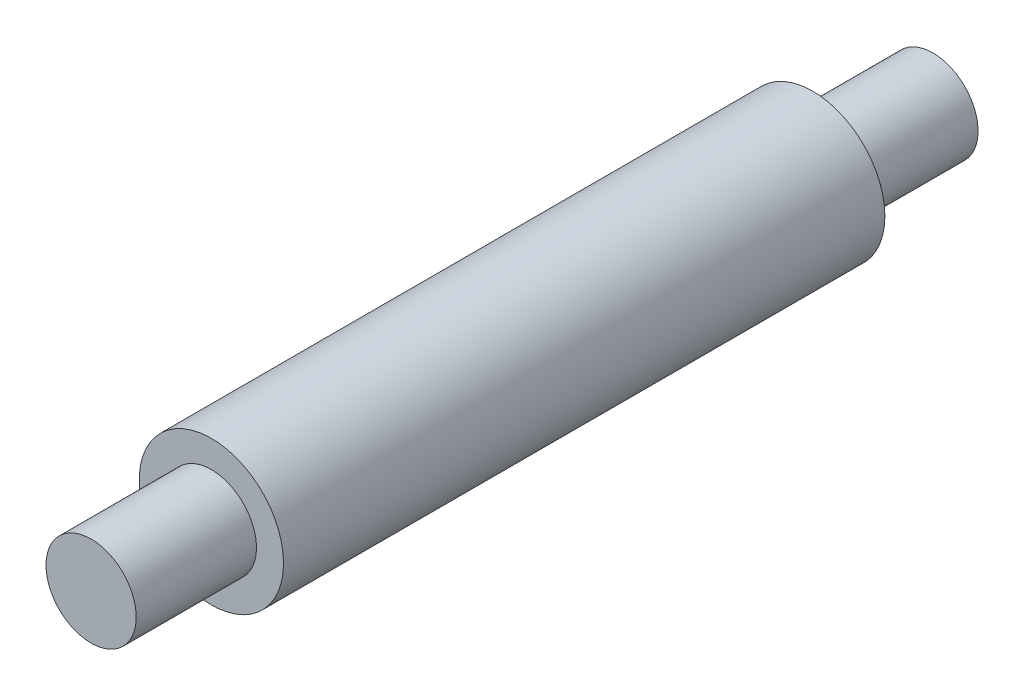
ISO-10303-21;
HEADER;
FILE_DESCRIPTION(('STEP AP214'),'2;1');
FILE_NAME('part.step','',(''),(''),'','','');
FILE_SCHEMA(('AUTOMOTIVE_DESIGN { 1 0 10303 214 1 1 1 1 }'));
ENDSEC;
DATA;
#1=APPLICATION_CONTEXT('core data for automotive mechanical design processes');
#2=APPLICATION_PROTOCOL_DEFINITION('international standard','automotive_design',2000,#1);
#3=PRODUCT_CONTEXT('',#1,'mechanical');
#4=PRODUCT('Part','Part','',(#3));
#5=PRODUCT_RELATED_PRODUCT_CATEGORY('part','',(#4));
#6=PRODUCT_DEFINITION_FORMATION('','',#4);
#7=PRODUCT_DEFINITION_CONTEXT('part definition',#1,'design');
#8=PRODUCT_DEFINITION('design','',#6,#7);
#9=PRODUCT_DEFINITION_SHAPE('','',#8);
#10=(LENGTH_UNIT() NAMED_UNIT(*) SI_UNIT(.MILLI.,.METRE.));
#11=(NAMED_UNIT(*) PLANE_ANGLE_UNIT() SI_UNIT($,.RADIAN.));
#12=(NAMED_UNIT(*) SI_UNIT($,.STERADIAN.) SOLID_ANGLE_UNIT());
#13=UNCERTAINTY_MEASURE_WITH_UNIT(LENGTH_MEASURE(1.E-05),#10,'distance_accuracy_value','');
#14=(GEOMETRIC_REPRESENTATION_CONTEXT(3) GLOBAL_UNCERTAINTY_ASSIGNED_CONTEXT((#13)) GLOBAL_UNIT_ASSIGNED_CONTEXT((#10,
#11,#12)) REPRESENTATION_CONTEXT('',''));
#15=CARTESIAN_POINT('',(0.,0.,0.));
#16=DIRECTION('',(0.,0.,1.));
#17=DIRECTION('',(1.,0.,0.));
#18=AXIS2_PLACEMENT_3D('',#15,#16,#17);
#19=CARTESIAN_POINT('',(0.,0.,200.));
#20=DIRECTION('',(0.,0.,-1.));
#21=DIRECTION('',(-1.,0.,0.));
#22=AXIS2_PLACEMENT_3D('',#19,#20,#21);
#23=CYLINDRICAL_SURFACE('',#22,24.);
#24=CARTESIAN_POINT('',(0.,0.,200.));
#25=DIRECTION('',(0.,0.,1.));
#26=DIRECTION('',(1.,0.,0.));
#27=AXIS2_PLACEMENT_3D('',#24,#25,#26);
#28=CIRCLE('',#27,24.);
#29=CARTESIAN_POINT('',(24.,0.,200.));
#30=VERTEX_POINT('',#29);
#31=EDGE_CURVE('E45',#30,#30,#28,.T.);
#32=ORIENTED_EDGE('',*,*,#31,.F.);
#33=EDGE_LOOP('',(#32));
#34=FACE_BOUND('',#33,.T.);
#35=CARTESIAN_POINT('',(0.,0.,0.));
#36=DIRECTION('',(0.,0.,1.));
#37=DIRECTION('',(1.,0.,0.));
#38=AXIS2_PLACEMENT_3D('',#35,#36,#37);
#39=CIRCLE('',#38,24.);
#40=CARTESIAN_POINT('',(24.,0.,0.));
#41=VERTEX_POINT('',#40);
#42=EDGE_CURVE('E40',#41,#41,#39,.T.);
#43=ORIENTED_EDGE('',*,*,#42,.T.);
#44=EDGE_LOOP('',(#43));
#45=FACE_BOUND('',#44,.T.);
#46=ADVANCED_FACE('F37',(#34,#45),#23,.T.);
#47=CARTESIAN_POINT('',(0.,0.,200.));
#48=DIRECTION('',(0.,0.,1.));
#49=DIRECTION('',(1.,0.,0.));
#50=AXIS2_PLACEMENT_3D('',#47,#48,#49);
#51=PLANE('',#50);
#52=CARTESIAN_POINT('',(0.,0.,200.));
#53=DIRECTION('',(0.,0.,-1.));
#54=DIRECTION('',(-1.,0.,0.));
#55=AXIS2_PLACEMENT_3D('',#52,#53,#54);
#56=CIRCLE('',#55,15.);
#57=CARTESIAN_POINT('',(-15.,0.,200.));
#58=VERTEX_POINT('',#57);
#59=EDGE_CURVE('E56',#58,#58,#56,.T.);
#60=ORIENTED_EDGE('',*,*,#59,.T.);
#61=EDGE_LOOP('',(#60));
#62=FACE_BOUND('',#61,.T.);
#63=ORIENTED_EDGE('',*,*,#31,.T.);
#64=EDGE_LOOP('',(#63));
#65=FACE_BOUND('',#64,.T.);
#66=ADVANCED_FACE('F65',(#62,#65),#51,.T.);
#67=CARTESIAN_POINT('',(0.,0.,0.));
#68=DIRECTION('',(0.,0.,1.));
#69=DIRECTION('',(1.,0.,0.));
#70=AXIS2_PLACEMENT_3D('',#67,#68,#69);
#71=PLANE('',#70);
#72=CARTESIAN_POINT('',(0.,0.,0.));
#73=DIRECTION('',(0.,0.,-1.));
#74=DIRECTION('',(-1.,0.,0.));
#75=AXIS2_PLACEMENT_3D('',#72,#73,#74);
#76=CIRCLE('',#75,15.);
#77=CARTESIAN_POINT('',(-15.,0.,0.));
#78=VERTEX_POINT('',#77);
#79=EDGE_CURVE('E10',#78,#78,#76,.T.);
#80=ORIENTED_EDGE('',*,*,#79,.F.);
#81=EDGE_LOOP('',(#80));
#82=FACE_BOUND('',#81,.T.);
#83=ORIENTED_EDGE('',*,*,#42,.F.);
#84=EDGE_LOOP('',(#83));
#85=FACE_BOUND('',#84,.T.);
#86=ADVANCED_FACE('F85',(#82,#85),#71,.F.);
#87=CARTESIAN_POINT('',(0.,0.,-40.));
#88=DIRECTION('',(0.,0.,1.));
#89=DIRECTION('',(1.,0.,0.));
#90=AXIS2_PLACEMENT_3D('',#87,#88,#89);
#91=CYLINDRICAL_SURFACE('',#90,15.);
#92=CARTESIAN_POINT('',(0.,0.,-40.));
#93=DIRECTION('',(0.,0.,-1.));
#94=DIRECTION('',(-1.,0.,0.));
#95=AXIS2_PLACEMENT_3D('',#92,#93,#94);
#96=CIRCLE('',#95,15.);
#97=CARTESIAN_POINT('',(-15.,0.,-40.));
#98=VERTEX_POINT('',#97);
#99=EDGE_CURVE('E52',#98,#98,#96,.T.);
#100=ORIENTED_EDGE('',*,*,#99,.F.);
#101=EDGE_LOOP('',(#100));
#102=FACE_BOUND('',#101,.T.);
#103=ORIENTED_EDGE('',*,*,#79,.T.);
#104=EDGE_LOOP('',(#103));
#105=FACE_BOUND('',#104,.T.);
#106=ADVANCED_FACE('F94',(#102,#105),#91,.T.);
#107=CARTESIAN_POINT('',(0.,0.,-40.));
#108=DIRECTION('',(0.,0.,-1.));
#109=DIRECTION('',(-1.,0.,0.));
#110=AXIS2_PLACEMENT_3D('',#107,#108,#109);
#111=PLANE('',#110);
#112=ORIENTED_EDGE('',*,*,#99,.T.);
#113=EDGE_LOOP('',(#112));
#114=FACE_BOUND('',#113,.T.);
#115=ADVANCED_FACE('F72',(#114),#111,.T.);
#116=CARTESIAN_POINT('',(0.,0.,200.));
#117=DIRECTION('',(0.,0.,1.));
#118=DIRECTION('',(1.,0.,0.));
#119=AXIS2_PLACEMENT_3D('',#116,#117,#118);
#120=CYLINDRICAL_SURFACE('',#119,15.);
#121=ORIENTED_EDGE('',*,*,#59,.F.);
#122=EDGE_LOOP('',(#121));
#123=FACE_BOUND('',#122,.T.);
#124=CARTESIAN_POINT('',(0.,0.,240.));
#125=DIRECTION('',(0.,0.,-1.));
#126=DIRECTION('',(-1.,0.,0.));
#127=AXIS2_PLACEMENT_3D('',#124,#125,#126);
#128=CIRCLE('',#127,15.);
#129=CARTESIAN_POINT('',(-15.,0.,240.));
#130=VERTEX_POINT('',#129);
#131=EDGE_CURVE('E57',#130,#130,#128,.T.);
#132=ORIENTED_EDGE('',*,*,#131,.T.);
#133=EDGE_LOOP('',(#132));
#134=FACE_BOUND('',#133,.T.);
#135=ADVANCED_FACE('F68',(#123,#134),#120,.T.);
#136=CARTESIAN_POINT('',(0.,0.,240.));
#137=DIRECTION('',(0.,0.,-1.));
#138=DIRECTION('',(-1.,0.,0.));
#139=AXIS2_PLACEMENT_3D('',#136,#137,#138);
#140=PLANE('',#139);
#141=ORIENTED_EDGE('',*,*,#131,.F.);
#142=EDGE_LOOP('',(#141));
#143=FACE_BOUND('',#142,.T.);
#144=ADVANCED_FACE('F71',(#143),#140,.F.);
#145=CLOSED_SHELL('',(#46,#66,#86,#106,#115,#135,#144));
#146=MANIFOLD_SOLID_BREP('B2',#145);
#147=ADVANCED_BREP_SHAPE_REPRESENTATION('',(#18,#146),#14);
#148=SHAPE_DEFINITION_REPRESENTATION(#9,#147);
ENDSEC;
END-ISO-10303-21;
